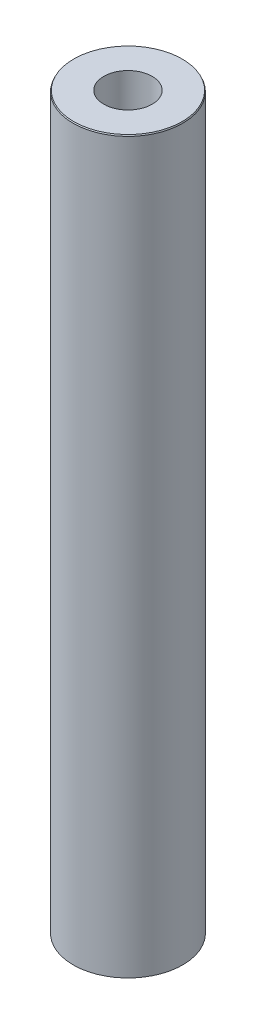
ISO-10303-21;
HEADER;
FILE_DESCRIPTION(('STEP AP214'),'2;1');
FILE_NAME('part.step','',(''),(''),'','','');
FILE_SCHEMA(('AUTOMOTIVE_DESIGN { 1 0 10303 214 1 1 1 1 }'));
ENDSEC;
DATA;
#1=APPLICATION_CONTEXT('core data for automotive mechanical design processes');
#2=APPLICATION_PROTOCOL_DEFINITION('international standard','automotive_design',2000,#1);
#3=PRODUCT_CONTEXT('',#1,'mechanical');
#4=PRODUCT('Part','Part','',(#3));
#5=PRODUCT_RELATED_PRODUCT_CATEGORY('part','',(#4));
#6=PRODUCT_DEFINITION_FORMATION('','',#4);
#7=PRODUCT_DEFINITION_CONTEXT('part definition',#1,'design');
#8=PRODUCT_DEFINITION('design','',#6,#7);
#9=PRODUCT_DEFINITION_SHAPE('','',#8);
#10=(LENGTH_UNIT() NAMED_UNIT(*) SI_UNIT(.MILLI.,.METRE.));
#11=(NAMED_UNIT(*) PLANE_ANGLE_UNIT() SI_UNIT($,.RADIAN.));
#12=(NAMED_UNIT(*) SI_UNIT($,.STERADIAN.) SOLID_ANGLE_UNIT());
#13=UNCERTAINTY_MEASURE_WITH_UNIT(LENGTH_MEASURE(1.E-05),#10,'distance_accuracy_value','');
#14=(GEOMETRIC_REPRESENTATION_CONTEXT(3) GLOBAL_UNCERTAINTY_ASSIGNED_CONTEXT((#13)) GLOBAL_UNIT_ASSIGNED_CONTEXT((#10,
#11,#12)) REPRESENTATION_CONTEXT('',''));
#15=CARTESIAN_POINT('',(0.,0.,0.));
#16=DIRECTION('',(0.,0.,1.));
#17=DIRECTION('',(1.,0.,0.));
#18=AXIS2_PLACEMENT_3D('',#15,#16,#17);
#19=CARTESIAN_POINT('',(0.,600.,0.));
#20=DIRECTION('',(0.,-1.,0.));
#21=DIRECTION('',(0.,0.,-1.));
#22=AXIS2_PLACEMENT_3D('',#19,#20,#21);
#23=CYLINDRICAL_SURFACE('',#22,45.);
#24=CARTESIAN_POINT('',(0.,599.004451566717,0.));
#25=DIRECTION('',(0.,1.,0.));
#26=DIRECTION('',(0.,0.,1.));
#27=AXIS2_PLACEMENT_3D('',#24,#25,#26);
#28=CIRCLE('',#27,45.);
#29=CARTESIAN_POINT('',(0.,599.004451566717,45.));
#30=VERTEX_POINT('',#29);
#31=EDGE_CURVE('E50',#30,#30,#28,.F.);
#32=ORIENTED_EDGE('',*,*,#31,.T.);
#33=EDGE_LOOP('',(#32));
#34=FACE_BOUND('',#33,.T.);
#35=CARTESIAN_POINT('',(0.,0.469440044063796,0.));
#36=DIRECTION('',(0.,1.,0.));
#37=DIRECTION('',(0.,0.,1.));
#38=AXIS2_PLACEMENT_3D('',#35,#36,#37);
#39=CIRCLE('',#38,45.);
#40=CARTESIAN_POINT('',(0.,0.469440044063796,45.));
#41=VERTEX_POINT('',#40);
#42=EDGE_CURVE('E51',#41,#41,#39,.T.);
#43=ORIENTED_EDGE('',*,*,#42,.T.);
#44=EDGE_LOOP('',(#43));
#45=FACE_BOUND('',#44,.T.);
#46=ADVANCED_FACE('F39',(#34,#45),#23,.T.);
#47=CARTESIAN_POINT('',(0.,600.,0.));
#48=DIRECTION('',(0.,1.,0.));
#49=DIRECTION('',(0.,0.,1.));
#50=AXIS2_PLACEMENT_3D('',#47,#48,#49);
#51=PLANE('',#50);
#52=CARTESIAN_POINT('',(0.,600.,0.));
#53=DIRECTION('',(0.,1.,0.));
#54=DIRECTION('',(0.,0.,1.));
#55=AXIS2_PLACEMENT_3D('',#52,#53,#54);
#56=CIRCLE('',#55,44.5305599559364);
#57=CARTESIAN_POINT('',(0.,600.,44.5305599559364));
#58=VERTEX_POINT('',#57);
#59=EDGE_CURVE('E54',#58,#58,#56,.T.);
#60=ORIENTED_EDGE('',*,*,#59,.T.);
#61=EDGE_LOOP('',(#60));
#62=FACE_BOUND('',#61,.T.);
#63=CARTESIAN_POINT('',(0.,600.,0.));
#64=DIRECTION('',(0.,1.,0.));
#65=DIRECTION('',(0.,0.,1.));
#66=AXIS2_PLACEMENT_3D('',#63,#64,#65);
#67=CIRCLE('',#66,19.8654104580595);
#68=CARTESIAN_POINT('',(0.,600.,19.8654104580595));
#69=VERTEX_POINT('',#68);
#70=EDGE_CURVE('E58',#69,#69,#67,.T.);
#71=ORIENTED_EDGE('',*,*,#70,.F.);
#72=EDGE_LOOP('',(#71));
#73=FACE_BOUND('',#72,.T.);
#74=ADVANCED_FACE('F69',(#62,#73),#51,.T.);
#75=CARTESIAN_POINT('',(0.,0.,0.));
#76=DIRECTION('',(0.,1.,0.));
#77=DIRECTION('',(0.,0.,1.));
#78=AXIS2_PLACEMENT_3D('',#75,#76,#77);
#79=PLANE('',#78);
#80=CARTESIAN_POINT('',(0.,0.,0.));
#81=DIRECTION('',(0.,1.,0.));
#82=DIRECTION('',(0.,0.,1.));
#83=AXIS2_PLACEMENT_3D('',#80,#81,#82);
#84=CIRCLE('',#83,44.004451566717);
#85=CARTESIAN_POINT('',(0.,0.,44.004451566717));
#86=VERTEX_POINT('',#85);
#87=EDGE_CURVE('E10',#86,#86,#84,.F.);
#88=ORIENTED_EDGE('',*,*,#87,.T.);
#89=EDGE_LOOP('',(#88));
#90=FACE_BOUND('',#89,.T.);
#91=CARTESIAN_POINT('',(0.,0.,0.));
#92=DIRECTION('',(0.,1.,0.));
#93=DIRECTION('',(0.,0.,1.));
#94=AXIS2_PLACEMENT_3D('',#91,#92,#93);
#95=CIRCLE('',#94,19.8654104580595);
#96=CARTESIAN_POINT('',(0.,0.,19.8654104580595));
#97=VERTEX_POINT('',#96);
#98=EDGE_CURVE('E63',#97,#97,#95,.T.);
#99=ORIENTED_EDGE('',*,*,#98,.T.);
#100=EDGE_LOOP('',(#99));
#101=FACE_BOUND('',#100,.T.);
#102=ADVANCED_FACE('F75',(#90,#101),#79,.F.);
#103=CARTESIAN_POINT('',(0.,600.,0.));
#104=DIRECTION('',(0.,-1.,0.));
#105=DIRECTION('',(0.,0.,-1.));
#106=AXIS2_PLACEMENT_3D('',#103,#104,#105);
#107=CYLINDRICAL_SURFACE('',#106,19.8654104580595);
#108=ORIENTED_EDGE('',*,*,#70,.T.);
#109=EDGE_LOOP('',(#108));
#110=FACE_BOUND('',#109,.T.);
#111=ORIENTED_EDGE('',*,*,#98,.F.);
#112=EDGE_LOOP('',(#111));
#113=FACE_BOUND('',#112,.T.);
#114=ADVANCED_FACE('F70',(#110,#113),#107,.F.);
#115=CARTESIAN_POINT('',(0.,600.,0.));
#116=DIRECTION('',(0.,-1.,0.));
#117=DIRECTION('',(0.,0.,-1.));
#118=AXIS2_PLACEMENT_3D('',#115,#116,#117);
#119=CONICAL_SURFACE('',#118,44.5305599559364,0.440620793705023);
#120=ORIENTED_EDGE('',*,*,#31,.F.);
#121=EDGE_LOOP('',(#120));
#122=FACE_BOUND('',#121,.T.);
#123=ORIENTED_EDGE('',*,*,#59,.F.);
#124=EDGE_LOOP('',(#123));
#125=FACE_BOUND('',#124,.T.);
#126=ADVANCED_FACE('F81',(#122,#125),#119,.T.);
#127=CARTESIAN_POINT('',(0.,0.469440044063796,0.));
#128=DIRECTION('',(0.,1.,0.));
#129=DIRECTION('',(0.,0.,1.));
#130=AXIS2_PLACEMENT_3D('',#127,#128,#129);
#131=CONICAL_SURFACE('',#130,45.,1.13017553308983);
#132=ORIENTED_EDGE('',*,*,#87,.F.);
#133=EDGE_LOOP('',(#132));
#134=FACE_BOUND('',#133,.T.);
#135=ORIENTED_EDGE('',*,*,#42,.F.);
#136=EDGE_LOOP('',(#135));
#137=FACE_BOUND('',#136,.T.);
#138=ADVANCED_FACE('F45',(#134,#137),#131,.T.);
#139=CLOSED_SHELL('',(#46,#74,#102,#114,#126,#138));
#140=MANIFOLD_SOLID_BREP('B2',#139);
#141=ADVANCED_BREP_SHAPE_REPRESENTATION('',(#18,#140),#14);
#142=SHAPE_DEFINITION_REPRESENTATION(#9,#141);
ENDSEC;
END-ISO-10303-21;
